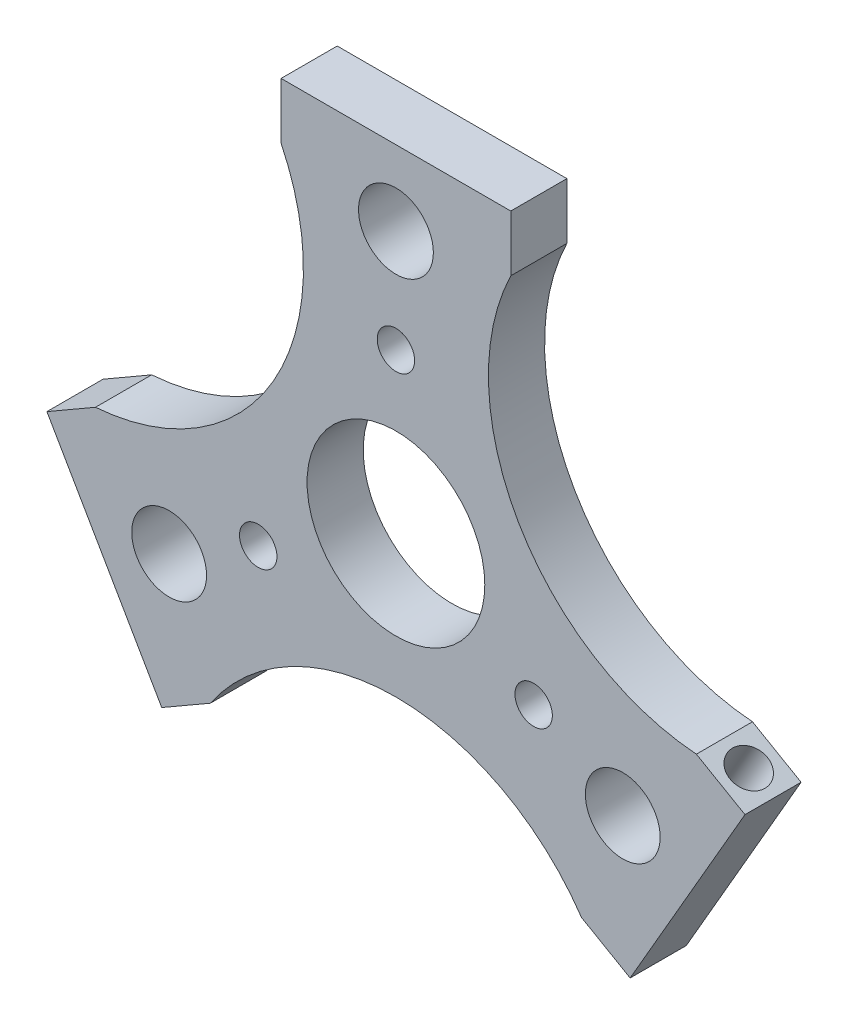
ISO-10303-21;
HEADER;
FILE_DESCRIPTION(('STEP AP214'),'2;1');
FILE_NAME('part.step','',(''),(''),'','','');
FILE_SCHEMA(('AUTOMOTIVE_DESIGN { 1 0 10303 214 1 1 1 1 }'));
ENDSEC;
DATA;
#1=APPLICATION_CONTEXT('core data for automotive mechanical design processes');
#2=APPLICATION_PROTOCOL_DEFINITION('international standard','automotive_design',2000,#1);
#3=PRODUCT_CONTEXT('',#1,'mechanical');
#4=PRODUCT('Part','Part','',(#3));
#5=PRODUCT_RELATED_PRODUCT_CATEGORY('part','',(#4));
#6=PRODUCT_DEFINITION_FORMATION('','',#4);
#7=PRODUCT_DEFINITION_CONTEXT('part definition',#1,'design');
#8=PRODUCT_DEFINITION('design','',#6,#7);
#9=PRODUCT_DEFINITION_SHAPE('','',#8);
#10=(LENGTH_UNIT() NAMED_UNIT(*) SI_UNIT(.MILLI.,.METRE.));
#11=(NAMED_UNIT(*) PLANE_ANGLE_UNIT() SI_UNIT($,.RADIAN.));
#12=(NAMED_UNIT(*) SI_UNIT($,.STERADIAN.) SOLID_ANGLE_UNIT());
#13=UNCERTAINTY_MEASURE_WITH_UNIT(LENGTH_MEASURE(1.E-05),#10,'distance_accuracy_value','');
#14=(GEOMETRIC_REPRESENTATION_CONTEXT(3) GLOBAL_UNCERTAINTY_ASSIGNED_CONTEXT((#13)) GLOBAL_UNIT_ASSIGNED_CONTEXT((#10,
#11,#12)) REPRESENTATION_CONTEXT('',''));
#15=CARTESIAN_POINT('',(0.,0.,0.));
#16=DIRECTION('',(0.,0.,1.));
#17=DIRECTION('',(1.,0.,0.));
#18=AXIS2_PLACEMENT_3D('',#15,#16,#17);
#19=CARTESIAN_POINT('',(6.13833967127618,-10.631916184766,22.));
#20=DIRECTION('',(-0.500000000000001,0.866025403784438,0.));
#21=DIRECTION('',(-0.866025403784438,-0.500000000000001,0.));
#22=AXIS2_PLACEMENT_3D('',#19,#20,#21);
#23=PLANE('',#22);
#24=CARTESIAN_POINT('',(-22.4404986536102,-27.1319161847661,19.));
#25=DIRECTION('',(0.500000000000004,-0.866025403784436,0.));
#26=DIRECTION('',(0.,0.,1.));
#27=AXIS2_PLACEMENT_3D('',#24,#25,#26);
#28=CIRCLE('',#27,2.00000000000001);
#29=CARTESIAN_POINT('',(-22.4404986536102,-27.1319161847661,21.));
#30=VERTEX_POINT('',#29);
#31=EDGE_CURVE('E601',#30,#30,#28,.T.);
#32=ORIENTED_EDGE('',*,*,#31,.F.);
#33=EDGE_LOOP('',(#32));
#34=FACE_BOUND('',#33,.T.);
#35=DIRECTION('',(0.866025403784438,0.500000000000001,0.));
#36=VECTOR('',#35,1.);
#37=CARTESIAN_POINT('',(6.13833967127618,-10.631916184766,16.));
#38=LINE('',#37,#36);
#39=CARTESIAN_POINT('',(-25.0385748649636,-28.631916184766,16.));
#40=VERTEX_POINT('',#39);
#41=CARTESIAN_POINT('',(-19.842422442257,-25.631916184766,16.));
#42=VERTEX_POINT('',#41);
#43=EDGE_CURVE('E192',#40,#42,#38,.T.);
#44=ORIENTED_EDGE('',*,*,#43,.T.);
#45=DIRECTION('',(0.,0.,-1.));
#46=VECTOR('',#45,1.);
#47=CARTESIAN_POINT('',(-19.842422442257,-25.631916184766,22.));
#48=LINE('',#47,#46);
#49=CARTESIAN_POINT('',(-19.842422442257,-25.631916184766,22.));
#50=VERTEX_POINT('',#49);
#51=EDGE_CURVE('E11',#50,#42,#48,.T.);
#52=ORIENTED_EDGE('',*,*,#51,.F.);
#53=DIRECTION('',(0.866025403784438,0.500000000000001,0.));
#54=VECTOR('',#53,1.);
#55=CARTESIAN_POINT('',(6.13833967127618,-10.631916184766,22.));
#56=LINE('',#55,#54);
#57=CARTESIAN_POINT('',(-25.0385748649636,-28.631916184766,22.));
#58=VERTEX_POINT('',#57);
#59=EDGE_CURVE('E260',#58,#50,#56,.T.);
#60=ORIENTED_EDGE('',*,*,#59,.F.);
#61=DIRECTION('',(0.,0.,-1.));
#62=VECTOR('',#61,1.);
#63=CARTESIAN_POINT('',(-25.0385748649636,-28.631916184766,22.));
#64=LINE('',#63,#62);
#65=EDGE_CURVE('E64',#58,#40,#64,.T.);
#66=ORIENTED_EDGE('',*,*,#65,.T.);
#67=EDGE_LOOP('',(#44,#52,#60,#66));
#68=FACE_BOUND('',#67,.T.);
#69=ADVANCED_FACE('F47',(#34,#68),#23,.F.);
#70=CARTESIAN_POINT('',(0.,-39.13296324131,22.));
#71=DIRECTION('',(0.,0.,-1.));
#72=DIRECTION('',(-1.,0.,0.));
#73=AXIS2_PLACEMENT_3D('',#70,#71,#72);
#74=CYLINDRICAL_SURFACE('',#73,24.);
#75=CARTESIAN_POINT('',(0.,-39.13296324131,16.));
#76=DIRECTION('',(0.,0.,1.));
#77=DIRECTION('',(1.,0.,0.));
#78=AXIS2_PLACEMENT_3D('',#75,#76,#77);
#79=CIRCLE('',#78,24.);
#80=CARTESIAN_POINT('',(19.842422442257,-25.631916184766,16.));
#81=VERTEX_POINT('',#80);
#82=EDGE_CURVE('E194',#42,#81,#79,.F.);
#83=ORIENTED_EDGE('',*,*,#82,.T.);
#84=DIRECTION('',(0.,0.,-1.));
#85=VECTOR('',#84,1.);
#86=CARTESIAN_POINT('',(19.842422442257,-25.631916184766,22.));
#87=LINE('',#86,#85);
#88=CARTESIAN_POINT('',(19.842422442257,-25.631916184766,22.));
#89=VERTEX_POINT('',#88);
#90=EDGE_CURVE('E56',#89,#81,#87,.T.);
#91=ORIENTED_EDGE('',*,*,#90,.F.);
#92=CARTESIAN_POINT('',(0.,-39.13296324131,22.));
#93=DIRECTION('',(0.,0.,1.));
#94=DIRECTION('',(1.,0.,0.));
#95=AXIS2_PLACEMENT_3D('',#92,#93,#94);
#96=CIRCLE('',#95,24.);
#97=EDGE_CURVE('E114',#50,#89,#96,.F.);
#98=ORIENTED_EDGE('',*,*,#97,.F.);
#99=ORIENTED_EDGE('',*,*,#51,.T.);
#100=EDGE_LOOP('',(#83,#91,#98,#99));
#101=FACE_BOUND('',#100,.T.);
#102=ADVANCED_FACE('F244',(#101),#74,.F.);
#103=CARTESIAN_POINT('',(-6.13833967127618,-10.631916184766,22.));
#104=DIRECTION('',(-0.499999999999999,-0.866025403784439,0.));
#105=DIRECTION('',(0.866025403784439,-0.499999999999999,0.));
#106=AXIS2_PLACEMENT_3D('',#103,#104,#105);
#107=PLANE('',#106);
#108=DIRECTION('',(-0.866025403784439,0.499999999999999,0.));
#109=VECTOR('',#108,1.);
#110=CARTESIAN_POINT('',(-6.13833967127618,-10.631916184766,16.));
#111=LINE('',#110,#109);
#112=CARTESIAN_POINT('',(25.0385748649636,-28.631916184766,16.));
#113=VERTEX_POINT('',#112);
#114=EDGE_CURVE('E197',#113,#81,#111,.T.);
#115=ORIENTED_EDGE('',*,*,#114,.F.);
#116=DIRECTION('',(0.,0.,-1.));
#117=VECTOR('',#116,1.);
#118=CARTESIAN_POINT('',(25.0385748649636,-28.631916184766,22.));
#119=LINE('',#118,#117);
#120=CARTESIAN_POINT('',(25.0385748649636,-28.631916184766,22.));
#121=VERTEX_POINT('',#120);
#122=EDGE_CURVE('E237',#121,#113,#119,.T.);
#123=ORIENTED_EDGE('',*,*,#122,.F.);
#124=DIRECTION('',(-0.866025403784439,0.499999999999999,0.));
#125=VECTOR('',#124,1.);
#126=CARTESIAN_POINT('',(-6.13833967127618,-10.631916184766,22.));
#127=LINE('',#126,#125);
#128=EDGE_CURVE('E243',#121,#89,#127,.T.);
#129=ORIENTED_EDGE('',*,*,#128,.T.);
#130=ORIENTED_EDGE('',*,*,#90,.T.);
#131=EDGE_LOOP('',(#115,#123,#129,#130));
#132=FACE_BOUND('',#131,.T.);
#133=ADVANCED_FACE('F241',(#132),#107,.T.);
#134=CARTESIAN_POINT('',(31.1769145362398,-18.,22.));
#135=DIRECTION('',(0.866025403784439,-0.5,0.));
#136=DIRECTION('',(0.5,0.866025403784439,0.));
#137=AXIS2_PLACEMENT_3D('',#134,#135,#136);
#138=PLANE('',#137);
#139=DIRECTION('',(-0.5,-0.866025403784439,0.));
#140=VECTOR('',#139,1.);
#141=CARTESIAN_POINT('',(31.1769145362398,-18.,16.));
#142=LINE('',#141,#140);
#143=CARTESIAN_POINT('',(37.315254207516,-7.36808381523401,16.));
#144=VERTEX_POINT('',#143);
#145=EDGE_CURVE('E200',#144,#113,#142,.T.);
#146=ORIENTED_EDGE('',*,*,#145,.F.);
#147=DIRECTION('',(0.,0.,-1.));
#148=VECTOR('',#147,1.);
#149=CARTESIAN_POINT('',(37.315254207516,-7.36808381523401,22.));
#150=LINE('',#149,#148);
#151=CARTESIAN_POINT('',(37.315254207516,-7.36808381523401,22.));
#152=VERTEX_POINT('',#151);
#153=EDGE_CURVE('E235',#152,#144,#150,.T.);
#154=ORIENTED_EDGE('',*,*,#153,.F.);
#155=DIRECTION('',(-0.5,-0.866025403784439,0.));
#156=VECTOR('',#155,1.);
#157=CARTESIAN_POINT('',(31.1769145362398,-18.,22.));
#158=LINE('',#157,#156);
#159=EDGE_CURVE('E256',#152,#121,#158,.T.);
#160=ORIENTED_EDGE('',*,*,#159,.T.);
#161=ORIENTED_EDGE('',*,*,#122,.T.);
#162=EDGE_LOOP('',(#146,#154,#160,#161));
#163=FACE_BOUND('',#162,.T.);
#164=ADVANCED_FACE('F252',(#163),#138,.T.);
#165=CARTESIAN_POINT('',(6.13833967127618,10.631916184766,22.));
#166=DIRECTION('',(-0.5,-0.866025403784439,0.));
#167=DIRECTION('',(0.866025403784439,-0.5,0.));
#168=AXIS2_PLACEMENT_3D('',#165,#166,#167);
#169=PLANE('',#168);
#170=CARTESIAN_POINT('',(34.7171779961627,-5.8680838152337,19.));
#171=DIRECTION('',(0.499999999999992,0.866025403784443,0.));
#172=DIRECTION('',(0.,0.,1.));
#173=AXIS2_PLACEMENT_3D('',#170,#171,#172);
#174=CIRCLE('',#173,2.00000000000001);
#175=CARTESIAN_POINT('',(32.9851271885938,-4.86808381523371,19.));
#176=VERTEX_POINT('',#175);
#177=EDGE_CURVE('E595',#176,#176,#174,.T.);
#178=ORIENTED_EDGE('',*,*,#177,.F.);
#179=EDGE_LOOP('',(#178));
#180=FACE_BOUND('',#179,.T.);
#181=DIRECTION('',(-0.866025403784439,0.5,0.));
#182=VECTOR('',#181,1.);
#183=CARTESIAN_POINT('',(6.13833967127618,10.631916184766,16.));
#184=LINE('',#183,#182);
#185=CARTESIAN_POINT('',(32.1191017848093,-4.36808381523401,16.));
#186=VERTEX_POINT('',#185);
#187=EDGE_CURVE('E203',#144,#186,#184,.T.);
#188=ORIENTED_EDGE('',*,*,#187,.T.);
#189=DIRECTION('',(0.,0.,-1.));
#190=VECTOR('',#189,1.);
#191=CARTESIAN_POINT('',(32.1191017848093,-4.36808381523401,22.));
#192=LINE('',#191,#190);
#193=CARTESIAN_POINT('',(32.1191017848093,-4.36808381523401,22.));
#194=VERTEX_POINT('',#193);
#195=EDGE_CURVE('E232',#194,#186,#192,.T.);
#196=ORIENTED_EDGE('',*,*,#195,.F.);
#197=DIRECTION('',(-0.866025403784439,0.5,0.));
#198=VECTOR('',#197,1.);
#199=CARTESIAN_POINT('',(6.13833967127618,10.631916184766,22.));
#200=LINE('',#199,#198);
#201=EDGE_CURVE('E258',#152,#194,#200,.T.);
#202=ORIENTED_EDGE('',*,*,#201,.F.);
#203=ORIENTED_EDGE('',*,*,#153,.T.);
#204=EDGE_LOOP('',(#188,#196,#202,#203));
#205=FACE_BOUND('',#204,.T.);
#206=ADVANCED_FACE('F535',(#180,#205),#169,.F.);
#207=CARTESIAN_POINT('',(33.8901402923371,19.566481620655,22.));
#208=DIRECTION('',(0.,0.,-1.));
#209=DIRECTION('',(-1.,0.,0.));
#210=AXIS2_PLACEMENT_3D('',#207,#208,#209);
#211=CYLINDRICAL_SURFACE('',#210,24.);
#212=CARTESIAN_POINT('',(33.8901402923371,19.566481620655,16.));
#213=DIRECTION('',(0.,0.,1.));
#214=DIRECTION('',(1.,0.,0.));
#215=AXIS2_PLACEMENT_3D('',#212,#213,#214);
#216=CIRCLE('',#215,24.);
#217=CARTESIAN_POINT('',(12.2766793425524,30.,16.));
#218=VERTEX_POINT('',#217);
#219=EDGE_CURVE('E205',#186,#218,#216,.F.);
#220=ORIENTED_EDGE('',*,*,#219,.T.);
#221=DIRECTION('',(0.,0.,-1.));
#222=VECTOR('',#221,1.);
#223=CARTESIAN_POINT('',(12.2766793425524,30.,22.));
#224=LINE('',#223,#222);
#225=CARTESIAN_POINT('',(12.2766793425524,30.,22.));
#226=VERTEX_POINT('',#225);
#227=EDGE_CURVE('E230',#226,#218,#224,.T.);
#228=ORIENTED_EDGE('',*,*,#227,.F.);
#229=CARTESIAN_POINT('',(33.8901402923371,19.566481620655,22.));
#230=DIRECTION('',(0.,0.,1.));
#231=DIRECTION('',(1.,0.,0.));
#232=AXIS2_PLACEMENT_3D('',#229,#230,#231);
#233=CIRCLE('',#232,24.);
#234=EDGE_CURVE('E265',#194,#226,#233,.F.);
#235=ORIENTED_EDGE('',*,*,#234,.F.);
#236=ORIENTED_EDGE('',*,*,#195,.T.);
#237=EDGE_LOOP('',(#220,#228,#235,#236));
#238=FACE_BOUND('',#237,.T.);
#239=ADVANCED_FACE('F530',(#238),#211,.F.);
#240=CARTESIAN_POINT('',(12.2766793425524,0.,22.));
#241=DIRECTION('',(1.,0.,0.));
#242=DIRECTION('',(0.,0.,-1.));
#243=AXIS2_PLACEMENT_3D('',#240,#241,#242);
#244=PLANE('',#243);
#245=DIRECTION('',(0.,-1.,0.));
#246=VECTOR('',#245,1.);
#247=CARTESIAN_POINT('',(12.2766793425524,0.,16.));
#248=LINE('',#247,#246);
#249=CARTESIAN_POINT('',(12.2766793425524,36.,16.));
#250=VERTEX_POINT('',#249);
#251=EDGE_CURVE('E208',#250,#218,#248,.T.);
#252=ORIENTED_EDGE('',*,*,#251,.F.);
#253=DIRECTION('',(0.,0.,-1.));
#254=VECTOR('',#253,1.);
#255=CARTESIAN_POINT('',(12.2766793425524,36.,22.));
#256=LINE('',#255,#254);
#257=CARTESIAN_POINT('',(12.2766793425524,36.,22.));
#258=VERTEX_POINT('',#257);
#259=EDGE_CURVE('E228',#258,#250,#256,.T.);
#260=ORIENTED_EDGE('',*,*,#259,.F.);
#261=DIRECTION('',(0.,-1.,0.));
#262=VECTOR('',#261,1.);
#263=CARTESIAN_POINT('',(12.2766793425524,0.,22.));
#264=LINE('',#263,#262);
#265=EDGE_CURVE('E267',#258,#226,#264,.T.);
#266=ORIENTED_EDGE('',*,*,#265,.T.);
#267=ORIENTED_EDGE('',*,*,#227,.T.);
#268=EDGE_LOOP('',(#252,#260,#266,#267));
#269=FACE_BOUND('',#268,.T.);
#270=ADVANCED_FACE('F280',(#269),#244,.T.);
#271=CARTESIAN_POINT('',(0.,36.,22.));
#272=DIRECTION('',(0.,1.,0.));
#273=DIRECTION('',(0.,0.,1.));
#274=AXIS2_PLACEMENT_3D('',#271,#272,#273);
#275=PLANE('',#274);
#276=DIRECTION('',(1.,0.,0.));
#277=VECTOR('',#276,1.);
#278=CARTESIAN_POINT('',(0.,36.,16.));
#279=LINE('',#278,#277);
#280=CARTESIAN_POINT('',(-12.2766793425524,36.,16.));
#281=VERTEX_POINT('',#280);
#282=EDGE_CURVE('E211',#281,#250,#279,.T.);
#283=ORIENTED_EDGE('',*,*,#282,.F.);
#284=DIRECTION('',(0.,0.,-1.));
#285=VECTOR('',#284,1.);
#286=CARTESIAN_POINT('',(-12.2766793425524,36.,22.));
#287=LINE('',#286,#285);
#288=CARTESIAN_POINT('',(-12.2766793425524,36.,22.));
#289=VERTEX_POINT('',#288);
#290=EDGE_CURVE('E226',#289,#281,#287,.T.);
#291=ORIENTED_EDGE('',*,*,#290,.F.);
#292=DIRECTION('',(1.,0.,0.));
#293=VECTOR('',#292,1.);
#294=CARTESIAN_POINT('',(0.,36.,22.));
#295=LINE('',#294,#293);
#296=EDGE_CURVE('E270',#289,#258,#295,.T.);
#297=ORIENTED_EDGE('',*,*,#296,.T.);
#298=ORIENTED_EDGE('',*,*,#259,.T.);
#299=EDGE_LOOP('',(#283,#291,#297,#298));
#300=FACE_BOUND('',#299,.T.);
#301=ADVANCED_FACE('F274',(#300),#275,.T.);
#302=CARTESIAN_POINT('',(-12.2766793425524,0.,22.));
#303=DIRECTION('',(1.,0.,0.));
#304=DIRECTION('',(0.,0.,-1.));
#305=AXIS2_PLACEMENT_3D('',#302,#303,#304);
#306=PLANE('',#305);
#307=CARTESIAN_POINT('',(-12.2766793425524,33.,19.));
#308=DIRECTION('',(-1.,0.,0.));
#309=DIRECTION('',(0.,0.,1.));
#310=AXIS2_PLACEMENT_3D('',#307,#308,#309);
#311=CIRCLE('',#310,2.00000000000001);
#312=CARTESIAN_POINT('',(-12.2766793425524,33.,21.));
#313=VERTEX_POINT('',#312);
#314=EDGE_CURVE('E607',#313,#313,#311,.T.);
#315=ORIENTED_EDGE('',*,*,#314,.F.);
#316=EDGE_LOOP('',(#315));
#317=FACE_BOUND('',#316,.T.);
#318=DIRECTION('',(0.,-1.,0.));
#319=VECTOR('',#318,1.);
#320=CARTESIAN_POINT('',(-12.2766793425524,0.,16.));
#321=LINE('',#320,#319);
#322=CARTESIAN_POINT('',(-12.2766793425524,30.,16.));
#323=VERTEX_POINT('',#322);
#324=EDGE_CURVE('E214',#281,#323,#321,.T.);
#325=ORIENTED_EDGE('',*,*,#324,.T.);
#326=DIRECTION('',(0.,0.,-1.));
#327=VECTOR('',#326,1.);
#328=CARTESIAN_POINT('',(-12.2766793425524,30.,22.));
#329=LINE('',#328,#327);
#330=CARTESIAN_POINT('',(-12.2766793425524,30.,22.));
#331=VERTEX_POINT('',#330);
#332=EDGE_CURVE('E162',#331,#323,#329,.T.);
#333=ORIENTED_EDGE('',*,*,#332,.F.);
#334=DIRECTION('',(0.,-1.,0.));
#335=VECTOR('',#334,1.);
#336=CARTESIAN_POINT('',(-12.2766793425524,0.,22.));
#337=LINE('',#336,#335);
#338=EDGE_CURVE('E150',#289,#331,#337,.T.);
#339=ORIENTED_EDGE('',*,*,#338,.F.);
#340=ORIENTED_EDGE('',*,*,#290,.T.);
#341=EDGE_LOOP('',(#325,#333,#339,#340));
#342=FACE_BOUND('',#341,.T.);
#343=ADVANCED_FACE('F283',(#317,#342),#306,.F.);
#344=CARTESIAN_POINT('',(-33.8901402923371,19.566481620655,22.));
#345=DIRECTION('',(0.,0.,-1.));
#346=DIRECTION('',(-1.,0.,0.));
#347=AXIS2_PLACEMENT_3D('',#344,#345,#346);
#348=CYLINDRICAL_SURFACE('',#347,24.);
#349=CARTESIAN_POINT('',(-33.8901402923371,19.566481620655,16.));
#350=DIRECTION('',(0.,0.,1.));
#351=DIRECTION('',(1.,0.,0.));
#352=AXIS2_PLACEMENT_3D('',#349,#350,#351);
#353=CIRCLE('',#352,24.);
#354=CARTESIAN_POINT('',(-32.1191017848094,-4.36808381523402,16.));
#355=VERTEX_POINT('',#354);
#356=EDGE_CURVE('E159',#323,#355,#353,.F.);
#357=ORIENTED_EDGE('',*,*,#356,.T.);
#358=DIRECTION('',(0.,0.,-1.));
#359=VECTOR('',#358,1.);
#360=CARTESIAN_POINT('',(-32.1191017848094,-4.36808381523402,22.));
#361=LINE('',#360,#359);
#362=CARTESIAN_POINT('',(-32.1191017848094,-4.36808381523402,22.));
#363=VERTEX_POINT('',#362);
#364=EDGE_CURVE('E156',#363,#355,#361,.T.);
#365=ORIENTED_EDGE('',*,*,#364,.F.);
#366=CARTESIAN_POINT('',(-33.8901402923371,19.566481620655,22.));
#367=DIRECTION('',(0.,0.,1.));
#368=DIRECTION('',(1.,0.,0.));
#369=AXIS2_PLACEMENT_3D('',#366,#367,#368);
#370=CIRCLE('',#369,24.);
#371=EDGE_CURVE('E142',#331,#363,#370,.F.);
#372=ORIENTED_EDGE('',*,*,#371,.F.);
#373=ORIENTED_EDGE('',*,*,#332,.T.);
#374=EDGE_LOOP('',(#357,#365,#372,#373));
#375=FACE_BOUND('',#374,.T.);
#376=ADVANCED_FACE('F157',(#375),#348,.F.);
#377=CARTESIAN_POINT('',(-6.1383396712763,10.6319161847661,22.));
#378=DIRECTION('',(-0.500000000000004,0.866025403784436,0.));
#379=DIRECTION('',(-0.866025403784436,-0.500000000000004,0.));
#380=AXIS2_PLACEMENT_3D('',#377,#378,#379);
#381=PLANE('',#380);
#382=DIRECTION('',(0.866025403784436,0.500000000000004,0.));
#383=VECTOR('',#382,1.);
#384=CARTESIAN_POINT('',(-6.1383396712763,10.6319161847661,16.));
#385=LINE('',#384,#383);
#386=CARTESIAN_POINT('',(-37.315254207516,-7.36808381523404,16.));
#387=VERTEX_POINT('',#386);
#388=EDGE_CURVE('E217',#387,#355,#385,.T.);
#389=ORIENTED_EDGE('',*,*,#388,.F.);
#390=DIRECTION('',(0.,0.,-1.));
#391=VECTOR('',#390,1.);
#392=CARTESIAN_POINT('',(-37.315254207516,-7.36808381523404,22.));
#393=LINE('',#392,#391);
#394=CARTESIAN_POINT('',(-37.315254207516,-7.36808381523404,22.));
#395=VERTEX_POINT('',#394);
#396=EDGE_CURVE('E102',#395,#387,#393,.T.);
#397=ORIENTED_EDGE('',*,*,#396,.F.);
#398=DIRECTION('',(0.866025403784436,0.500000000000004,0.));
#399=VECTOR('',#398,1.);
#400=CARTESIAN_POINT('',(-6.1383396712763,10.6319161847661,22.));
#401=LINE('',#400,#399);
#402=EDGE_CURVE('E147',#395,#363,#401,.T.);
#403=ORIENTED_EDGE('',*,*,#402,.T.);
#404=ORIENTED_EDGE('',*,*,#364,.T.);
#405=EDGE_LOOP('',(#389,#397,#403,#404));
#406=FACE_BOUND('',#405,.T.);
#407=ADVANCED_FACE('F164',(#406),#381,.T.);
#408=CARTESIAN_POINT('',(0.,28.,22.));
#409=DIRECTION('',(0.,0.,-1.));
#410=DIRECTION('',(-1.,0.,0.));
#411=AXIS2_PLACEMENT_3D('',#408,#409,#410);
#412=CYLINDRICAL_SURFACE('',#411,4.);
#413=CARTESIAN_POINT('',(0.,28.,22.));
#414=DIRECTION('',(0.,0.,1.));
#415=DIRECTION('',(1.,0.,0.));
#416=AXIS2_PLACEMENT_3D('',#413,#414,#415);
#417=CIRCLE('',#416,4.);
#418=CARTESIAN_POINT('',(4.,28.,22.));
#419=VERTEX_POINT('',#418);
#420=EDGE_CURVE('E626',#419,#419,#417,.T.);
#421=ORIENTED_EDGE('',*,*,#420,.T.);
#422=EDGE_LOOP('',(#421));
#423=FACE_BOUND('',#422,.T.);
#424=CARTESIAN_POINT('',(0.,28.,16.));
#425=DIRECTION('',(0.,0.,1.));
#426=DIRECTION('',(1.,0.,0.));
#427=AXIS2_PLACEMENT_3D('',#424,#425,#426);
#428=CIRCLE('',#427,4.);
#429=CARTESIAN_POINT('',(4.,28.,16.));
#430=VERTEX_POINT('',#429);
#431=EDGE_CURVE('E189',#430,#430,#428,.T.);
#432=ORIENTED_EDGE('',*,*,#431,.F.);
#433=EDGE_LOOP('',(#432));
#434=FACE_BOUND('',#433,.T.);
#435=ADVANCED_FACE('F306',(#423,#434),#412,.F.);
#436=CARTESIAN_POINT('',(0.,17.,22.));
#437=DIRECTION('',(0.,0.,-1.));
#438=DIRECTION('',(-1.,0.,0.));
#439=AXIS2_PLACEMENT_3D('',#436,#437,#438);
#440=CYLINDRICAL_SURFACE('',#439,2.);
#441=CARTESIAN_POINT('',(0.,17.,22.));
#442=DIRECTION('',(0.,0.,1.));
#443=DIRECTION('',(1.,0.,0.));
#444=AXIS2_PLACEMENT_3D('',#441,#442,#443);
#445=CIRCLE('',#444,2.);
#446=CARTESIAN_POINT('',(2.,17.,22.));
#447=VERTEX_POINT('',#446);
#448=EDGE_CURVE('E623',#447,#447,#445,.T.);
#449=ORIENTED_EDGE('',*,*,#448,.T.);
#450=EDGE_LOOP('',(#449));
#451=FACE_BOUND('',#450,.T.);
#452=CARTESIAN_POINT('',(0.,17.,16.));
#453=DIRECTION('',(0.,0.,1.));
#454=DIRECTION('',(1.,0.,0.));
#455=AXIS2_PLACEMENT_3D('',#452,#453,#454);
#456=CIRCLE('',#455,2.);
#457=CARTESIAN_POINT('',(2.,17.,16.));
#458=VERTEX_POINT('',#457);
#459=EDGE_CURVE('E186',#458,#458,#456,.T.);
#460=ORIENTED_EDGE('',*,*,#459,.F.);
#461=EDGE_LOOP('',(#460));
#462=FACE_BOUND('',#461,.T.);
#463=ADVANCED_FACE('F309',(#451,#462),#440,.F.);
#464=CARTESIAN_POINT('',(24.2487113059643,-14.,22.));
#465=DIRECTION('',(0.,0.,-1.));
#466=DIRECTION('',(-1.,0.,0.));
#467=AXIS2_PLACEMENT_3D('',#464,#465,#466);
#468=CYLINDRICAL_SURFACE('',#467,4.);
#469=CARTESIAN_POINT('',(24.2487113059643,-14.,22.));
#470=DIRECTION('',(0.,0.,1.));
#471=DIRECTION('',(1.,0.,0.));
#472=AXIS2_PLACEMENT_3D('',#469,#470,#471);
#473=CIRCLE('',#472,4.);
#474=CARTESIAN_POINT('',(28.2487113059643,-14.,22.));
#475=VERTEX_POINT('',#474);
#476=EDGE_CURVE('E620',#475,#475,#473,.T.);
#477=ORIENTED_EDGE('',*,*,#476,.T.);
#478=EDGE_LOOP('',(#477));
#479=FACE_BOUND('',#478,.T.);
#480=CARTESIAN_POINT('',(24.2487113059643,-14.,16.));
#481=DIRECTION('',(0.,0.,1.));
#482=DIRECTION('',(1.,0.,0.));
#483=AXIS2_PLACEMENT_3D('',#480,#481,#482);
#484=CIRCLE('',#483,4.);
#485=CARTESIAN_POINT('',(28.2487113059643,-14.,16.));
#486=VERTEX_POINT('',#485);
#487=EDGE_CURVE('E183',#486,#486,#484,.T.);
#488=ORIENTED_EDGE('',*,*,#487,.F.);
#489=EDGE_LOOP('',(#488));
#490=FACE_BOUND('',#489,.T.);
#491=ADVANCED_FACE('F313',(#479,#490),#468,.F.);
#492=CARTESIAN_POINT('',(14.7224318643355,-8.5,22.));
#493=DIRECTION('',(0.,0.,-1.));
#494=DIRECTION('',(-1.,0.,0.));
#495=AXIS2_PLACEMENT_3D('',#492,#493,#494);
#496=CYLINDRICAL_SURFACE('',#495,2.);
#497=CARTESIAN_POINT('',(14.7224318643355,-8.5,22.));
#498=DIRECTION('',(0.,0.,1.));
#499=DIRECTION('',(1.,0.,0.));
#500=AXIS2_PLACEMENT_3D('',#497,#498,#499);
#501=CIRCLE('',#500,2.);
#502=CARTESIAN_POINT('',(16.7224318643355,-8.5,22.));
#503=VERTEX_POINT('',#502);
#504=EDGE_CURVE('E617',#503,#503,#501,.T.);
#505=ORIENTED_EDGE('',*,*,#504,.T.);
#506=EDGE_LOOP('',(#505));
#507=FACE_BOUND('',#506,.T.);
#508=CARTESIAN_POINT('',(14.7224318643355,-8.5,16.));
#509=DIRECTION('',(0.,0.,1.));
#510=DIRECTION('',(1.,0.,0.));
#511=AXIS2_PLACEMENT_3D('',#508,#509,#510);
#512=CIRCLE('',#511,2.);
#513=CARTESIAN_POINT('',(16.7224318643355,-8.5,16.));
#514=VERTEX_POINT('',#513);
#515=EDGE_CURVE('E180',#514,#514,#512,.T.);
#516=ORIENTED_EDGE('',*,*,#515,.F.);
#517=EDGE_LOOP('',(#516));
#518=FACE_BOUND('',#517,.T.);
#519=ADVANCED_FACE('F317',(#507,#518),#496,.F.);
#520=CARTESIAN_POINT('',(-24.2487113059643,-14.,22.));
#521=DIRECTION('',(0.,0.,-1.));
#522=DIRECTION('',(-1.,0.,0.));
#523=AXIS2_PLACEMENT_3D('',#520,#521,#522);
#524=CYLINDRICAL_SURFACE('',#523,4.);
#525=CARTESIAN_POINT('',(-24.2487113059643,-14.,22.));
#526=DIRECTION('',(0.,0.,1.));
#527=DIRECTION('',(1.,0.,0.));
#528=AXIS2_PLACEMENT_3D('',#525,#526,#527);
#529=CIRCLE('',#528,4.);
#530=CARTESIAN_POINT('',(-20.2487113059643,-14.,22.));
#531=VERTEX_POINT('',#530);
#532=EDGE_CURVE('E614',#531,#531,#529,.T.);
#533=ORIENTED_EDGE('',*,*,#532,.T.);
#534=EDGE_LOOP('',(#533));
#535=FACE_BOUND('',#534,.T.);
#536=CARTESIAN_POINT('',(-24.2487113059643,-14.,16.));
#537=DIRECTION('',(0.,0.,1.));
#538=DIRECTION('',(1.,0.,0.));
#539=AXIS2_PLACEMENT_3D('',#536,#537,#538);
#540=CIRCLE('',#539,4.);
#541=CARTESIAN_POINT('',(-20.2487113059643,-14.,16.));
#542=VERTEX_POINT('',#541);
#543=EDGE_CURVE('E177',#542,#542,#540,.T.);
#544=ORIENTED_EDGE('',*,*,#543,.F.);
#545=EDGE_LOOP('',(#544));
#546=FACE_BOUND('',#545,.T.);
#547=ADVANCED_FACE('F321',(#535,#546),#524,.F.);
#548=CARTESIAN_POINT('',(-14.7224318643355,-8.50000000000001,22.));
#549=DIRECTION('',(0.,0.,-1.));
#550=DIRECTION('',(-1.,0.,0.));
#551=AXIS2_PLACEMENT_3D('',#548,#549,#550);
#552=CYLINDRICAL_SURFACE('',#551,2.);
#553=CARTESIAN_POINT('',(-14.7224318643355,-8.50000000000001,22.));
#554=DIRECTION('',(0.,0.,1.));
#555=DIRECTION('',(1.,0.,0.));
#556=AXIS2_PLACEMENT_3D('',#553,#554,#555);
#557=CIRCLE('',#556,2.);
#558=CARTESIAN_POINT('',(-12.7224318643355,-8.50000000000001,22.));
#559=VERTEX_POINT('',#558);
#560=EDGE_CURVE('E337',#559,#559,#557,.T.);
#561=ORIENTED_EDGE('',*,*,#560,.T.);
#562=EDGE_LOOP('',(#561));
#563=FACE_BOUND('',#562,.T.);
#564=CARTESIAN_POINT('',(-14.7224318643355,-8.50000000000001,16.));
#565=DIRECTION('',(0.,0.,1.));
#566=DIRECTION('',(1.,0.,0.));
#567=AXIS2_PLACEMENT_3D('',#564,#565,#566);
#568=CIRCLE('',#567,2.);
#569=CARTESIAN_POINT('',(-12.7224318643355,-8.50000000000001,16.));
#570=VERTEX_POINT('',#569);
#571=EDGE_CURVE('E173',#570,#570,#568,.T.);
#572=ORIENTED_EDGE('',*,*,#571,.F.);
#573=EDGE_LOOP('',(#572));
#574=FACE_BOUND('',#573,.T.);
#575=ADVANCED_FACE('F324',(#563,#574),#552,.F.);
#576=CARTESIAN_POINT('',(0.,0.,22.));
#577=DIRECTION('',(0.,0.,-1.));
#578=DIRECTION('',(-1.,0.,0.));
#579=AXIS2_PLACEMENT_3D('',#576,#577,#578);
#580=CYLINDRICAL_SURFACE('',#579,9.5);
#581=CARTESIAN_POINT('',(0.,0.,22.));
#582=DIRECTION('',(0.,0.,1.));
#583=DIRECTION('',(1.,0.,0.));
#584=AXIS2_PLACEMENT_3D('',#581,#582,#583);
#585=CIRCLE('',#584,9.5);
#586=CARTESIAN_POINT('',(9.50000000000001,0.,22.));
#587=VERTEX_POINT('',#586);
#588=EDGE_CURVE('E222',#587,#587,#585,.T.);
#589=ORIENTED_EDGE('',*,*,#588,.T.);
#590=EDGE_LOOP('',(#589));
#591=FACE_BOUND('',#590,.T.);
#592=CARTESIAN_POINT('',(0.,0.,16.));
#593=DIRECTION('',(0.,0.,1.));
#594=DIRECTION('',(1.,0.,0.));
#595=AXIS2_PLACEMENT_3D('',#592,#593,#594);
#596=CIRCLE('',#595,9.5);
#597=CARTESIAN_POINT('',(9.50000000000001,0.,16.));
#598=VERTEX_POINT('',#597);
#599=EDGE_CURVE('E170',#598,#598,#596,.T.);
#600=ORIENTED_EDGE('',*,*,#599,.F.);
#601=EDGE_LOOP('',(#600));
#602=FACE_BOUND('',#601,.T.);
#603=ADVANCED_FACE('F49',(#591,#602),#580,.F.);
#604=CARTESIAN_POINT('',(-31.1769145362398,-18.,22.));
#605=DIRECTION('',(-0.866025403784438,-0.5,0.));
#606=DIRECTION('',(0.5,-0.866025403784439,0.));
#607=AXIS2_PLACEMENT_3D('',#604,#605,#606);
#608=PLANE('',#607);
#609=DIRECTION('',(-0.5,0.866025403784438,0.));
#610=VECTOR('',#609,1.);
#611=CARTESIAN_POINT('',(-31.1769145362398,-18.,16.));
#612=LINE('',#611,#610);
#613=EDGE_CURVE('E219',#40,#387,#612,.T.);
#614=ORIENTED_EDGE('',*,*,#613,.F.);
#615=ORIENTED_EDGE('',*,*,#65,.F.);
#616=DIRECTION('',(-0.5,0.866025403784438,0.));
#617=VECTOR('',#616,1.);
#618=CARTESIAN_POINT('',(-31.1769145362398,-18.,22.));
#619=LINE('',#618,#617);
#620=EDGE_CURVE('E165',#58,#395,#619,.T.);
#621=ORIENTED_EDGE('',*,*,#620,.T.);
#622=ORIENTED_EDGE('',*,*,#396,.T.);
#623=EDGE_LOOP('',(#614,#615,#621,#622));
#624=FACE_BOUND('',#623,.T.);
#625=ADVANCED_FACE('F332',(#624),#608,.T.);
#626=CARTESIAN_POINT('',(0.,0.,22.));
#627=DIRECTION('',(0.,0.,1.));
#628=DIRECTION('',(1.,0.,0.));
#629=AXIS2_PLACEMENT_3D('',#626,#627,#628);
#630=PLANE('',#629);
#631=ORIENTED_EDGE('',*,*,#588,.F.);
#632=EDGE_LOOP('',(#631));
#633=FACE_BOUND('',#632,.T.);
#634=ORIENTED_EDGE('',*,*,#560,.F.);
#635=EDGE_LOOP('',(#634));
#636=FACE_BOUND('',#635,.T.);
#637=ORIENTED_EDGE('',*,*,#532,.F.);
#638=EDGE_LOOP('',(#637));
#639=FACE_BOUND('',#638,.T.);
#640=ORIENTED_EDGE('',*,*,#504,.F.);
#641=EDGE_LOOP('',(#640));
#642=FACE_BOUND('',#641,.T.);
#643=ORIENTED_EDGE('',*,*,#476,.F.);
#644=EDGE_LOOP('',(#643));
#645=FACE_BOUND('',#644,.T.);
#646=ORIENTED_EDGE('',*,*,#448,.F.);
#647=EDGE_LOOP('',(#646));
#648=FACE_BOUND('',#647,.T.);
#649=ORIENTED_EDGE('',*,*,#420,.F.);
#650=EDGE_LOOP('',(#649));
#651=FACE_BOUND('',#650,.T.);
#652=ORIENTED_EDGE('',*,*,#59,.T.);
#653=ORIENTED_EDGE('',*,*,#97,.T.);
#654=ORIENTED_EDGE('',*,*,#128,.F.);
#655=ORIENTED_EDGE('',*,*,#159,.F.);
#656=ORIENTED_EDGE('',*,*,#201,.T.);
#657=ORIENTED_EDGE('',*,*,#234,.T.);
#658=ORIENTED_EDGE('',*,*,#265,.F.);
#659=ORIENTED_EDGE('',*,*,#296,.F.);
#660=ORIENTED_EDGE('',*,*,#338,.T.);
#661=ORIENTED_EDGE('',*,*,#371,.T.);
#662=ORIENTED_EDGE('',*,*,#402,.F.);
#663=ORIENTED_EDGE('',*,*,#620,.F.);
#664=EDGE_LOOP('',(#652,#653,#654,#655,#656,#657,#658,#659,#660,#661,#662,#663));
#665=FACE_BOUND('',#664,.T.);
#666=ADVANCED_FACE('F144',(#633,#636,#639,#642,#645,#648,#651,#665),#630,.T.);
#667=CARTESIAN_POINT('',(0.,0.,16.));
#668=DIRECTION('',(0.,0.,1.));
#669=DIRECTION('',(1.,0.,0.));
#670=AXIS2_PLACEMENT_3D('',#667,#668,#669);
#671=PLANE('',#670);
#672=ORIENTED_EDGE('',*,*,#599,.T.);
#673=EDGE_LOOP('',(#672));
#674=FACE_BOUND('',#673,.T.);
#675=ORIENTED_EDGE('',*,*,#571,.T.);
#676=EDGE_LOOP('',(#675));
#677=FACE_BOUND('',#676,.T.);
#678=ORIENTED_EDGE('',*,*,#543,.T.);
#679=EDGE_LOOP('',(#678));
#680=FACE_BOUND('',#679,.T.);
#681=ORIENTED_EDGE('',*,*,#515,.T.);
#682=EDGE_LOOP('',(#681));
#683=FACE_BOUND('',#682,.T.);
#684=ORIENTED_EDGE('',*,*,#487,.T.);
#685=EDGE_LOOP('',(#684));
#686=FACE_BOUND('',#685,.T.);
#687=ORIENTED_EDGE('',*,*,#459,.T.);
#688=EDGE_LOOP('',(#687));
#689=FACE_BOUND('',#688,.T.);
#690=ORIENTED_EDGE('',*,*,#431,.T.);
#691=EDGE_LOOP('',(#690));
#692=FACE_BOUND('',#691,.T.);
#693=ORIENTED_EDGE('',*,*,#43,.F.);
#694=ORIENTED_EDGE('',*,*,#613,.T.);
#695=ORIENTED_EDGE('',*,*,#388,.T.);
#696=ORIENTED_EDGE('',*,*,#356,.F.);
#697=ORIENTED_EDGE('',*,*,#324,.F.);
#698=ORIENTED_EDGE('',*,*,#282,.T.);
#699=ORIENTED_EDGE('',*,*,#251,.T.);
#700=ORIENTED_EDGE('',*,*,#219,.F.);
#701=ORIENTED_EDGE('',*,*,#187,.F.);
#702=ORIENTED_EDGE('',*,*,#145,.T.);
#703=ORIENTED_EDGE('',*,*,#114,.T.);
#704=ORIENTED_EDGE('',*,*,#82,.F.);
#705=EDGE_LOOP('',(#693,#694,#695,#696,#697,#698,#699,#700,#701,#702,#703,#704));
#706=FACE_BOUND('',#705,.T.);
#707=ADVANCED_FACE('F247',(#674,#677,#680,#683,#686,#689,#692,#706),#671,.F.);
#708=CARTESIAN_POINT('',(-6.27667934255235,33.,19.));
#709=DIRECTION('',(-1.,0.,0.));
#710=DIRECTION('',(0.,0.,1.));
#711=AXIS2_PLACEMENT_3D('',#708,#709,#710);
#712=CYLINDRICAL_SURFACE('',#711,2.00000000000001);
#713=CARTESIAN_POINT('',(-6.27667934255235,33.,19.));
#714=DIRECTION('',(-1.,0.,0.));
#715=DIRECTION('',(0.,0.,1.));
#716=AXIS2_PLACEMENT_3D('',#713,#714,#715);
#717=CIRCLE('',#716,2.00000000000001);
#718=CARTESIAN_POINT('',(-6.27667934255235,33.,21.));
#719=VERTEX_POINT('',#718);
#720=EDGE_CURVE('E174',#719,#719,#717,.T.);
#721=ORIENTED_EDGE('',*,*,#720,.F.);
#722=EDGE_LOOP('',(#721));
#723=FACE_BOUND('',#722,.T.);
#724=ORIENTED_EDGE('',*,*,#314,.T.);
#725=EDGE_LOOP('',(#724));
#726=FACE_BOUND('',#725,.T.);
#727=ADVANCED_FACE('F342',(#723,#726),#712,.F.);
#728=CARTESIAN_POINT('',(-6.27667934255235,33.,19.));
#729=DIRECTION('',(-1.,0.,0.));
#730=DIRECTION('',(0.,0.,1.));
#731=AXIS2_PLACEMENT_3D('',#728,#729,#730);
#732=PLANE('',#731);
#733=ORIENTED_EDGE('',*,*,#720,.T.);
#734=EDGE_LOOP('',(#733));
#735=FACE_BOUND('',#734,.T.);
#736=ADVANCED_FACE('F364',(#735),#732,.T.);
#737=CARTESIAN_POINT('',(31.7171779961628,-11.0642362379404,19.));
#738=DIRECTION('',(0.499999999999992,0.866025403784443,0.));
#739=DIRECTION('',(-0.866025403784443,0.499999999999992,0.));
#740=AXIS2_PLACEMENT_3D('',#737,#738,#739);
#741=CYLINDRICAL_SURFACE('',#740,2.00000000000001);
#742=CARTESIAN_POINT('',(31.7171779961628,-11.0642362379404,19.));
#743=DIRECTION('',(0.499999999999992,0.866025403784443,0.));
#744=DIRECTION('',(0.,0.,1.));
#745=AXIS2_PLACEMENT_3D('',#742,#743,#744);
#746=CIRCLE('',#745,2.00000000000001);
#747=CARTESIAN_POINT('',(29.9851271885939,-10.0642362379404,19.));
#748=VERTEX_POINT('',#747);
#749=EDGE_CURVE('E598',#748,#748,#746,.T.);
#750=CARTESIAN_POINT('',(29.9851271885939,-10.0642362379404,19.));
#751=CARTESIAN_POINT('',(30.0163771885939,-10.0101096502038,19.));
#752=CARTESIAN_POINT('',(30.0476271885939,-9.95598306246731,19.));
#753=CARTESIAN_POINT('',(30.1101271885939,-9.84772988699426,19.));
#754=CARTESIAN_POINT('',(30.1413771885939,-9.79360329925773,19.));
#755=CARTESIAN_POINT('',(30.2038771885939,-9.68535012378467,19.));
#756=CARTESIAN_POINT('',(30.2351271885939,-9.63122353604815,19.));
#757=CARTESIAN_POINT('',(30.2976271885939,-9.52297036057509,19.));
#758=CARTESIAN_POINT('',(30.3288771885939,-9.46884377283856,19.));
#759=CARTESIAN_POINT('',(30.3913771885939,-9.36059059736551,19.));
#760=CARTESIAN_POINT('',(30.4226271885939,-9.30646400962898,19.));
#761=CARTESIAN_POINT('',(30.4851271885939,-9.19821083415592,19.));
#762=CARTESIAN_POINT('',(30.5163771885939,-9.1440842464194,19.));
#763=CARTESIAN_POINT('',(30.5788771885939,-9.03583107094634,19.));
#764=CARTESIAN_POINT('',(30.6101271885939,-8.98170448320981,19.));
#765=CARTESIAN_POINT('',(30.6726271885939,-8.87345130773676,19.));
#766=CARTESIAN_POINT('',(30.7038771885939,-8.81932472000023,19.));
#767=CARTESIAN_POINT('',(30.7663771885939,-8.71107154452718,19.));
#768=CARTESIAN_POINT('',(30.7976271885939,-8.65694495679065,19.));
#769=CARTESIAN_POINT('',(30.8601271885939,-8.54869178131759,19.));
#770=CARTESIAN_POINT('',(30.8913771885939,-8.49456519358107,19.));
#771=CARTESIAN_POINT('',(30.9538771885939,-8.38631201810801,19.));
#772=CARTESIAN_POINT('',(30.9851271885938,-8.33218543037148,19.));
#773=CARTESIAN_POINT('',(31.0476271885938,-8.22393225489843,19.));
#774=CARTESIAN_POINT('',(31.0788771885938,-8.1698056671619,19.));
#775=CARTESIAN_POINT('',(31.1413771885938,-8.06155249168884,19.));
#776=CARTESIAN_POINT('',(31.1726271885938,-8.00742590395232,19.));
#777=CARTESIAN_POINT('',(31.2351271885938,-7.89917272847926,19.));
#778=CARTESIAN_POINT('',(31.2663771885938,-7.84504614074273,19.));
#779=CARTESIAN_POINT('',(31.3288771885938,-7.73679296526968,19.));
#780=CARTESIAN_POINT('',(31.3601271885938,-7.68266637753315,19.));
#781=CARTESIAN_POINT('',(31.4226271885938,-7.57441320206009,19.));
#782=CARTESIAN_POINT('',(31.4538771885938,-7.52028661432357,19.));
#783=CARTESIAN_POINT('',(31.5163771885938,-7.41203343885051,19.));
#784=CARTESIAN_POINT('',(31.5476271885938,-7.35790685111398,19.));
#785=CARTESIAN_POINT('',(31.6101271885938,-7.24965367564093,19.));
#786=CARTESIAN_POINT('',(31.6413771885938,-7.1955270879044,19.));
#787=CARTESIAN_POINT('',(31.7038771885938,-7.08727391243135,19.));
#788=CARTESIAN_POINT('',(31.7351271885938,-7.03314732469482,19.));
#789=CARTESIAN_POINT('',(31.7976271885938,-6.92489414922176,19.));
#790=CARTESIAN_POINT('',(31.8288771885938,-6.87076756148523,19.));
#791=CARTESIAN_POINT('',(31.8913771885938,-6.76251438601218,19.));
#792=CARTESIAN_POINT('',(31.9226271885938,-6.70838779827565,19.));
#793=CARTESIAN_POINT('',(31.9851271885938,-6.6001346228026,19.));
#794=CARTESIAN_POINT('',(32.0163771885938,-6.54600803506607,19.));
#795=CARTESIAN_POINT('',(32.0788771885938,-6.43775485959301,19.));
#796=CARTESIAN_POINT('',(32.1101271885938,-6.38362827185649,19.));
#797=CARTESIAN_POINT('',(32.1726271885938,-6.27537509638343,19.));
#798=CARTESIAN_POINT('',(32.2038771885938,-6.2212485086469,19.));
#799=CARTESIAN_POINT('',(32.2663771885938,-6.11299533317385,19.));
#800=CARTESIAN_POINT('',(32.2976271885938,-6.05886874543732,19.));
#801=CARTESIAN_POINT('',(32.3601271885938,-5.95061556996427,19.));
#802=CARTESIAN_POINT('',(32.3913771885938,-5.89648898222774,19.));
#803=CARTESIAN_POINT('',(32.4538771885938,-5.78823580675468,19.));
#804=CARTESIAN_POINT('',(32.4851271885938,-5.73410921901815,19.));
#805=CARTESIAN_POINT('',(32.5476271885938,-5.6258560435451,19.));
#806=CARTESIAN_POINT('',(32.5788771885938,-5.57172945580857,19.));
#807=CARTESIAN_POINT('',(32.6413771885938,-5.46347628033552,19.));
#808=CARTESIAN_POINT('',(32.6726271885938,-5.40934969259899,19.));
#809=CARTESIAN_POINT('',(32.7351271885938,-5.30109651712593,19.));
#810=CARTESIAN_POINT('',(32.7663771885938,-5.2469699293894,19.));
#811=CARTESIAN_POINT('',(32.8288771885938,-5.13871675391635,19.));
#812=CARTESIAN_POINT('',(32.8601271885938,-5.08459016617982,19.));
#813=CARTESIAN_POINT('',(32.9226271885938,-4.97633699070677,19.));
#814=CARTESIAN_POINT('',(32.9538771885938,-4.92221040297024,19.));
#815=CARTESIAN_POINT('',(32.9851271885938,-4.86808381523371,19.));
#816=B_SPLINE_CURVE_WITH_KNOTS('',3,(#750,#751,#752,#753,#754,#755,#756,#757,#758,#759,#760,
#761,#762,#763,#764,#765,#766,#767,#768,#769,#770,#771,#772,#773,#774,#775,#776,#777,#778,#779,
#780,#781,#782,#783,#784,#785,#786,#787,#788,#789,#790,#791,#792,#793,#794,#795,#796,#797,#798,
#799,#800,#801,#802,#803,#804,#805,#806,#807,#808,#809,#810,#811,#812,#813,#814,#815),
.UNSPECIFIED.,.F.,.F.,(4,2,2,2,2,2,2,2,2,2,2,2,2,2,2,2,2,2,2,2,2,2,2,2,2,2,2,2,2,2,2,2,4),(0.,
0.187500000000002,0.375000000000001,0.562500000000002,0.750000000000001,0.937500000000002,1.125,
1.3125,1.5,1.6875,1.875,2.0625,2.25,2.4375,2.625,2.8125,3.,3.1875,3.375,3.5625,3.75,3.9375,
4.125,4.3125,4.5,4.6875,4.875,5.0625,5.25,5.4375,5.625,5.8125,6.),.UNSPECIFIED.);
#817=EDGE_CURVE('BSEAM442',#748,#176,#816,.T.);
#818=ORIENTED_EDGE('',*,*,#749,.F.);
#819=ORIENTED_EDGE('',*,*,#177,.T.);
#820=ORIENTED_EDGE('',*,*,#817,.T.);
#821=ORIENTED_EDGE('',*,*,#817,.F.);
#822=EDGE_LOOP('',(#818,#820,#819,#821));
#823=FACE_BOUND('',#822,.T.);
#824=ADVANCED_FACE('F442',(#823),#741,.F.);
#825=CARTESIAN_POINT('',(31.7171779961628,-11.0642362379404,19.));
#826=DIRECTION('',(0.499999999999992,0.866025403784443,0.));
#827=DIRECTION('',(0.,0.,1.));
#828=AXIS2_PLACEMENT_3D('',#825,#826,#827);
#829=PLANE('',#828);
#830=ORIENTED_EDGE('',*,*,#749,.T.);
#831=EDGE_LOOP('',(#830));
#832=FACE_BOUND('',#831,.T.);
#833=ADVANCED_FACE('F454',(#832),#829,.T.);
#834=CARTESIAN_POINT('',(-25.4404986536102,-21.9357637620595,19.));
#835=DIRECTION('',(0.500000000000004,-0.866025403784436,0.));
#836=DIRECTION('',(0.866025403784436,0.500000000000004,0.));
#837=AXIS2_PLACEMENT_3D('',#834,#835,#836);
#838=CYLINDRICAL_SURFACE('',#837,2.00000000000001);
#839=CARTESIAN_POINT('',(-25.4404986536102,-21.9357637620595,19.));
#840=DIRECTION('',(0.500000000000004,-0.866025403784436,0.));
#841=DIRECTION('',(0.,0.,1.));
#842=AXIS2_PLACEMENT_3D('',#839,#840,#841);
#843=CIRCLE('',#842,2.00000000000001);
#844=CARTESIAN_POINT('',(-25.4404986536102,-21.9357637620595,21.));
#845=VERTEX_POINT('',#844);
#846=EDGE_CURVE('E610',#845,#845,#843,.T.);
#847=ORIENTED_EDGE('',*,*,#846,.F.);
#848=EDGE_LOOP('',(#847));
#849=FACE_BOUND('',#848,.T.);
#850=ORIENTED_EDGE('',*,*,#31,.T.);
#851=EDGE_LOOP('',(#850));
#852=FACE_BOUND('',#851,.T.);
#853=ADVANCED_FACE('F466',(#849,#852),#838,.F.);
#854=CARTESIAN_POINT('',(-25.4404986536102,-21.9357637620595,19.));
#855=DIRECTION('',(0.500000000000004,-0.866025403784436,0.));
#856=DIRECTION('',(0.,0.,1.));
#857=AXIS2_PLACEMENT_3D('',#854,#855,#856);
#858=PLANE('',#857);
#859=ORIENTED_EDGE('',*,*,#846,.T.);
#860=EDGE_LOOP('',(#859));
#861=FACE_BOUND('',#860,.T.);
#862=ADVANCED_FACE('F478',(#861),#858,.T.);
#863=CLOSED_SHELL('',(#69,#102,#133,#164,#206,#239,#270,#301,#343,#376,#407,#435,#463,#491,#519,
#547,#575,#603,#625,#666,#707,#727,#736,#824,#833,#853,#862));
#864=MANIFOLD_SOLID_BREP('B2',#863);
#865=ADVANCED_BREP_SHAPE_REPRESENTATION('',(#18,#864),#14);
#866=SHAPE_DEFINITION_REPRESENTATION(#9,#865);
ENDSEC;
END-ISO-10303-21;
